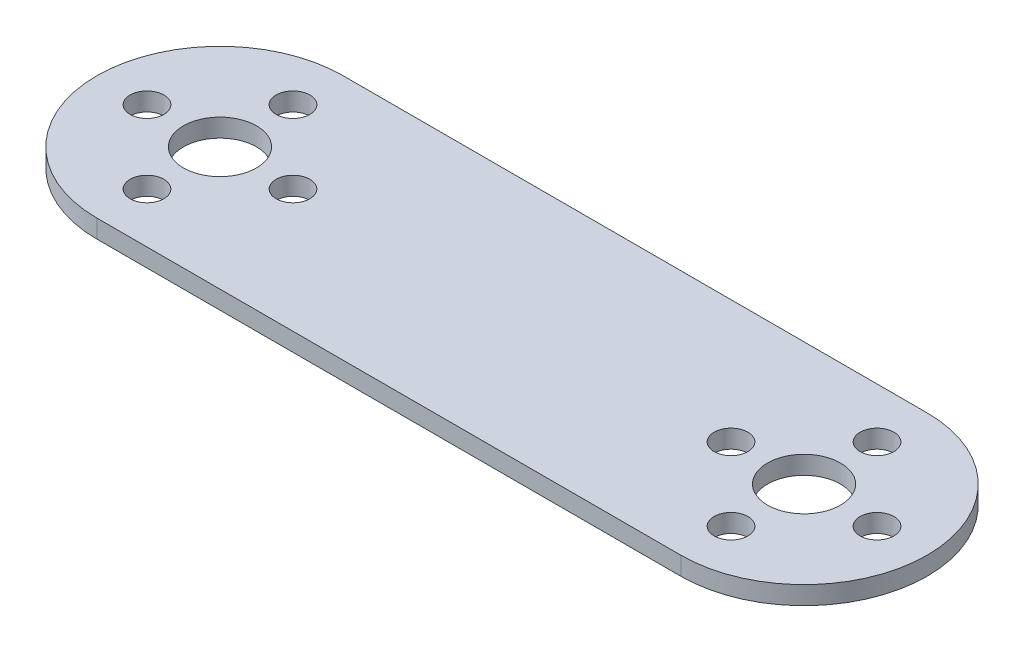
ISO-10303-21;
HEADER;
FILE_DESCRIPTION(('STEP AP214'),'2;1');
FILE_NAME('part.step','',(''),(''),'','','');
FILE_SCHEMA(('AUTOMOTIVE_DESIGN { 1 0 10303 214 1 1 1 1 }'));
ENDSEC;
DATA;
#1=APPLICATION_CONTEXT('core data for automotive mechanical design processes');
#2=APPLICATION_PROTOCOL_DEFINITION('international standard','automotive_design',2000,#1);
#3=PRODUCT_CONTEXT('',#1,'mechanical');
#4=PRODUCT('Part','Part','',(#3));
#5=PRODUCT_RELATED_PRODUCT_CATEGORY('part','',(#4));
#6=PRODUCT_DEFINITION_FORMATION('','',#4);
#7=PRODUCT_DEFINITION_CONTEXT('part definition',#1,'design');
#8=PRODUCT_DEFINITION('design','',#6,#7);
#9=PRODUCT_DEFINITION_SHAPE('','',#8);
#10=(LENGTH_UNIT() NAMED_UNIT(*) SI_UNIT(.MILLI.,.METRE.));
#11=(NAMED_UNIT(*) PLANE_ANGLE_UNIT() SI_UNIT($,.RADIAN.));
#12=(NAMED_UNIT(*) SI_UNIT($,.STERADIAN.) SOLID_ANGLE_UNIT());
#13=UNCERTAINTY_MEASURE_WITH_UNIT(LENGTH_MEASURE(1.E-05),#10,'distance_accuracy_value','');
#14=(GEOMETRIC_REPRESENTATION_CONTEXT(3) GLOBAL_UNCERTAINTY_ASSIGNED_CONTEXT((#13)) GLOBAL_UNIT_ASSIGNED_CONTEXT((#10,
#11,#12)) REPRESENTATION_CONTEXT('',''));
#15=CARTESIAN_POINT('',(0.,0.,0.));
#16=DIRECTION('',(0.,0.,1.));
#17=DIRECTION('',(1.,0.,0.));
#18=AXIS2_PLACEMENT_3D('',#15,#16,#17);
#19=CARTESIAN_POINT('',(32.,-1.,0.));
#20=DIRECTION('',(0.,1.,0.));
#21=DIRECTION('',(0.,0.,1.));
#22=AXIS2_PLACEMENT_3D('',#19,#20,#21);
#23=CYLINDRICAL_SURFACE('',#22,4.00000000000001);
#24=CARTESIAN_POINT('',(32.,-1.,0.));
#25=DIRECTION('',(0.,-1.,0.));
#26=DIRECTION('',(0.,0.,1.));
#27=AXIS2_PLACEMENT_3D('',#24,#25,#26);
#28=CIRCLE('',#27,4.00000000000001);
#29=CARTESIAN_POINT('',(32.,-1.,4.));
#30=VERTEX_POINT('',#29);
#31=EDGE_CURVE('E39',#30,#30,#28,.T.);
#32=ORIENTED_EDGE('',*,*,#31,.T.);
#33=EDGE_LOOP('',(#32));
#34=FACE_BOUND('',#33,.T.);
#35=CARTESIAN_POINT('',(32.,1.,0.));
#36=DIRECTION('',(0.,-1.,0.));
#37=DIRECTION('',(0.,0.,1.));
#38=AXIS2_PLACEMENT_3D('',#35,#36,#37);
#39=CIRCLE('',#38,4.00000000000001);
#40=CARTESIAN_POINT('',(32.,1.,4.));
#41=VERTEX_POINT('',#40);
#42=EDGE_CURVE('E11',#41,#41,#39,.T.);
#43=ORIENTED_EDGE('',*,*,#42,.F.);
#44=EDGE_LOOP('',(#43));
#45=FACE_BOUND('',#44,.T.);
#46=ADVANCED_FACE('F32',(#34,#45),#23,.F.);
#47=CARTESIAN_POINT('',(31.9999999999999,-1.,8.));
#48=DIRECTION('',(0.,1.,0.));
#49=DIRECTION('',(1.,0.,0.));
#50=AXIS2_PLACEMENT_3D('',#47,#48,#49);
#51=CYLINDRICAL_SURFACE('',#50,1.84999999999999);
#52=CARTESIAN_POINT('',(31.9999999999999,-1.,8.));
#53=DIRECTION('',(0.,-1.,0.));
#54=DIRECTION('',(1.,0.,0.));
#55=AXIS2_PLACEMENT_3D('',#52,#53,#54);
#56=CIRCLE('',#55,1.84999999999999);
#57=CARTESIAN_POINT('',(33.8499999999999,-1.,8.00000000000002));
#58=VERTEX_POINT('',#57);
#59=EDGE_CURVE('E149',#58,#58,#56,.T.);
#60=ORIENTED_EDGE('',*,*,#59,.T.);
#61=EDGE_LOOP('',(#60));
#62=FACE_BOUND('',#61,.T.);
#63=CARTESIAN_POINT('',(31.9999999999999,1.,8.));
#64=DIRECTION('',(0.,-1.,0.));
#65=DIRECTION('',(1.,0.,0.));
#66=AXIS2_PLACEMENT_3D('',#63,#64,#65);
#67=CIRCLE('',#66,1.84999999999999);
#68=CARTESIAN_POINT('',(33.8499999999999,1.,8.00000000000002));
#69=VERTEX_POINT('',#68);
#70=EDGE_CURVE('E152',#69,#69,#67,.T.);
#71=ORIENTED_EDGE('',*,*,#70,.F.);
#72=EDGE_LOOP('',(#71));
#73=FACE_BOUND('',#72,.T.);
#74=ADVANCED_FACE('F211',(#62,#73),#51,.F.);
#75=CARTESIAN_POINT('',(40.,-1.,0.));
#76=DIRECTION('',(0.,1.,0.));
#77=DIRECTION('',(0.,0.,-1.));
#78=AXIS2_PLACEMENT_3D('',#75,#76,#77);
#79=CYLINDRICAL_SURFACE('',#78,1.84999999999999);
#80=CARTESIAN_POINT('',(40.,-1.,0.));
#81=DIRECTION('',(0.,-1.,0.));
#82=DIRECTION('',(0.,0.,-1.));
#83=AXIS2_PLACEMENT_3D('',#80,#81,#82);
#84=CIRCLE('',#83,1.84999999999999);
#85=CARTESIAN_POINT('',(40.,-1.,-1.84999999999999));
#86=VERTEX_POINT('',#85);
#87=EDGE_CURVE('E143',#86,#86,#84,.T.);
#88=ORIENTED_EDGE('',*,*,#87,.T.);
#89=EDGE_LOOP('',(#88));
#90=FACE_BOUND('',#89,.T.);
#91=CARTESIAN_POINT('',(40.,1.,0.));
#92=DIRECTION('',(0.,-1.,0.));
#93=DIRECTION('',(0.,0.,-1.));
#94=AXIS2_PLACEMENT_3D('',#91,#92,#93);
#95=CIRCLE('',#94,1.84999999999999);
#96=CARTESIAN_POINT('',(40.,1.,-1.84999999999999));
#97=VERTEX_POINT('',#96);
#98=EDGE_CURVE('E146',#97,#97,#95,.T.);
#99=ORIENTED_EDGE('',*,*,#98,.F.);
#100=EDGE_LOOP('',(#99));
#101=FACE_BOUND('',#100,.T.);
#102=ADVANCED_FACE('F215',(#90,#101),#79,.F.);
#103=CARTESIAN_POINT('',(32.,-1.,-8.));
#104=DIRECTION('',(0.,1.,0.));
#105=DIRECTION('',(-1.,0.,0.));
#106=AXIS2_PLACEMENT_3D('',#103,#104,#105);
#107=CYLINDRICAL_SURFACE('',#106,1.84999999999999);
#108=CARTESIAN_POINT('',(32.,-1.,-8.));
#109=DIRECTION('',(0.,-1.,0.));
#110=DIRECTION('',(-1.,0.,0.));
#111=AXIS2_PLACEMENT_3D('',#108,#109,#110);
#112=CIRCLE('',#111,1.84999999999999);
#113=CARTESIAN_POINT('',(30.15,-1.,-8.00000000000001));
#114=VERTEX_POINT('',#113);
#115=EDGE_CURVE('E137',#114,#114,#112,.T.);
#116=ORIENTED_EDGE('',*,*,#115,.T.);
#117=EDGE_LOOP('',(#116));
#118=FACE_BOUND('',#117,.T.);
#119=CARTESIAN_POINT('',(32.,1.,-8.));
#120=DIRECTION('',(0.,-1.,0.));
#121=DIRECTION('',(-1.,0.,0.));
#122=AXIS2_PLACEMENT_3D('',#119,#120,#121);
#123=CIRCLE('',#122,1.84999999999999);
#124=CARTESIAN_POINT('',(30.15,1.,-8.00000000000001));
#125=VERTEX_POINT('',#124);
#126=EDGE_CURVE('E140',#125,#125,#123,.T.);
#127=ORIENTED_EDGE('',*,*,#126,.F.);
#128=EDGE_LOOP('',(#127));
#129=FACE_BOUND('',#128,.T.);
#130=ADVANCED_FACE('F220',(#118,#129),#107,.F.);
#131=CARTESIAN_POINT('',(24.,-1.,0.));
#132=DIRECTION('',(0.,1.,0.));
#133=DIRECTION('',(0.,0.,1.));
#134=AXIS2_PLACEMENT_3D('',#131,#132,#133);
#135=CYLINDRICAL_SURFACE('',#134,1.84999999999999);
#136=CARTESIAN_POINT('',(24.,-1.,0.));
#137=DIRECTION('',(0.,-1.,0.));
#138=DIRECTION('',(0.,0.,1.));
#139=AXIS2_PLACEMENT_3D('',#136,#137,#138);
#140=CIRCLE('',#139,1.84999999999999);
#141=CARTESIAN_POINT('',(24.,-1.,1.84999999999999));
#142=VERTEX_POINT('',#141);
#143=EDGE_CURVE('E131',#142,#142,#140,.T.);
#144=ORIENTED_EDGE('',*,*,#143,.T.);
#145=EDGE_LOOP('',(#144));
#146=FACE_BOUND('',#145,.T.);
#147=CARTESIAN_POINT('',(24.,1.,0.));
#148=DIRECTION('',(0.,-1.,0.));
#149=DIRECTION('',(0.,0.,1.));
#150=AXIS2_PLACEMENT_3D('',#147,#148,#149);
#151=CIRCLE('',#150,1.84999999999999);
#152=CARTESIAN_POINT('',(24.,1.,1.84999999999999));
#153=VERTEX_POINT('',#152);
#154=EDGE_CURVE('E134',#153,#153,#151,.T.);
#155=ORIENTED_EDGE('',*,*,#154,.F.);
#156=EDGE_LOOP('',(#155));
#157=FACE_BOUND('',#156,.T.);
#158=ADVANCED_FACE('F227',(#146,#157),#135,.F.);
#159=CARTESIAN_POINT('',(-31.9999999999999,-1.,8.));
#160=DIRECTION('',(0.,1.,0.));
#161=DIRECTION('',(-1.,0.,0.));
#162=AXIS2_PLACEMENT_3D('',#159,#160,#161);
#163=CYLINDRICAL_SURFACE('',#162,1.84999999999999);
#164=CARTESIAN_POINT('',(-31.9999999999999,-1.,8.));
#165=DIRECTION('',(0.,1.,0.));
#166=DIRECTION('',(-1.,0.,0.));
#167=AXIS2_PLACEMENT_3D('',#164,#165,#166);
#168=CIRCLE('',#167,1.84999999999999);
#169=CARTESIAN_POINT('',(-33.8499999999999,-1.,8.00000000000002));
#170=VERTEX_POINT('',#169);
#171=EDGE_CURVE('E125',#170,#170,#168,.T.);
#172=ORIENTED_EDGE('',*,*,#171,.F.);
#173=EDGE_LOOP('',(#172));
#174=FACE_BOUND('',#173,.T.);
#175=CARTESIAN_POINT('',(-31.9999999999999,1.,8.));
#176=DIRECTION('',(0.,1.,0.));
#177=DIRECTION('',(-1.,0.,0.));
#178=AXIS2_PLACEMENT_3D('',#175,#176,#177);
#179=CIRCLE('',#178,1.84999999999999);
#180=CARTESIAN_POINT('',(-33.8499999999999,1.,8.00000000000002));
#181=VERTEX_POINT('',#180);
#182=EDGE_CURVE('E128',#181,#181,#179,.T.);
#183=ORIENTED_EDGE('',*,*,#182,.T.);
#184=EDGE_LOOP('',(#183));
#185=FACE_BOUND('',#184,.T.);
#186=ADVANCED_FACE('F231',(#174,#185),#163,.F.);
#187=CARTESIAN_POINT('',(-40.,-1.,0.));
#188=DIRECTION('',(0.,1.,0.));
#189=DIRECTION('',(0.,0.,-1.));
#190=AXIS2_PLACEMENT_3D('',#187,#188,#189);
#191=CYLINDRICAL_SURFACE('',#190,1.84999999999999);
#192=CARTESIAN_POINT('',(-40.,-1.,0.));
#193=DIRECTION('',(0.,1.,0.));
#194=DIRECTION('',(0.,0.,-1.));
#195=AXIS2_PLACEMENT_3D('',#192,#193,#194);
#196=CIRCLE('',#195,1.84999999999999);
#197=CARTESIAN_POINT('',(-40.,-1.,-1.84999999999999));
#198=VERTEX_POINT('',#197);
#199=EDGE_CURVE('E119',#198,#198,#196,.T.);
#200=ORIENTED_EDGE('',*,*,#199,.F.);
#201=EDGE_LOOP('',(#200));
#202=FACE_BOUND('',#201,.T.);
#203=CARTESIAN_POINT('',(-40.,1.,0.));
#204=DIRECTION('',(0.,1.,0.));
#205=DIRECTION('',(0.,0.,-1.));
#206=AXIS2_PLACEMENT_3D('',#203,#204,#205);
#207=CIRCLE('',#206,1.84999999999999);
#208=CARTESIAN_POINT('',(-40.,1.,-1.84999999999999));
#209=VERTEX_POINT('',#208);
#210=EDGE_CURVE('E122',#209,#209,#207,.T.);
#211=ORIENTED_EDGE('',*,*,#210,.T.);
#212=EDGE_LOOP('',(#211));
#213=FACE_BOUND('',#212,.T.);
#214=ADVANCED_FACE('F207',(#202,#213),#191,.F.);
#215=CARTESIAN_POINT('',(-32.,-1.,-8.));
#216=DIRECTION('',(0.,1.,0.));
#217=DIRECTION('',(1.,0.,0.));
#218=AXIS2_PLACEMENT_3D('',#215,#216,#217);
#219=CYLINDRICAL_SURFACE('',#218,1.84999999999999);
#220=CARTESIAN_POINT('',(-32.,-1.,-8.));
#221=DIRECTION('',(0.,1.,0.));
#222=DIRECTION('',(1.,0.,0.));
#223=AXIS2_PLACEMENT_3D('',#220,#221,#222);
#224=CIRCLE('',#223,1.84999999999999);
#225=CARTESIAN_POINT('',(-30.15,-1.,-8.00000000000001));
#226=VERTEX_POINT('',#225);
#227=EDGE_CURVE('E113',#226,#226,#224,.T.);
#228=ORIENTED_EDGE('',*,*,#227,.F.);
#229=EDGE_LOOP('',(#228));
#230=FACE_BOUND('',#229,.T.);
#231=CARTESIAN_POINT('',(-32.,1.,-8.));
#232=DIRECTION('',(0.,1.,0.));
#233=DIRECTION('',(1.,0.,0.));
#234=AXIS2_PLACEMENT_3D('',#231,#232,#233);
#235=CIRCLE('',#234,1.84999999999999);
#236=CARTESIAN_POINT('',(-30.15,1.,-8.00000000000001));
#237=VERTEX_POINT('',#236);
#238=EDGE_CURVE('E116',#237,#237,#235,.T.);
#239=ORIENTED_EDGE('',*,*,#238,.T.);
#240=EDGE_LOOP('',(#239));
#241=FACE_BOUND('',#240,.T.);
#242=ADVANCED_FACE('F200',(#230,#241),#219,.F.);
#243=CARTESIAN_POINT('',(32.,-1.,0.));
#244=DIRECTION('',(0.,-1.,0.));
#245=DIRECTION('',(0.,0.,-1.));
#246=AXIS2_PLACEMENT_3D('',#243,#244,#245);
#247=CYLINDRICAL_SURFACE('',#246,13.5);
#248=DIRECTION('',(0.,-1.,0.));
#249=VECTOR('',#248,1.);
#250=CARTESIAN_POINT('',(32.,1.,13.5));
#251=LINE('',#250,#249);
#252=CARTESIAN_POINT('',(32.,-1.,13.5));
#253=VERTEX_POINT('',#252);
#254=CARTESIAN_POINT('',(32.,1.,13.5));
#255=VERTEX_POINT('',#254);
#256=EDGE_CURVE('E84',#253,#255,#251,.F.);
#257=ORIENTED_EDGE('',*,*,#256,.F.);
#258=CARTESIAN_POINT('',(32.,-1.,0.));
#259=DIRECTION('',(0.,-1.,0.));
#260=DIRECTION('',(0.,0.,-1.));
#261=AXIS2_PLACEMENT_3D('',#258,#259,#260);
#262=CIRCLE('',#261,13.5);
#263=CARTESIAN_POINT('',(32.,-1.,-13.5));
#264=VERTEX_POINT('',#263);
#265=EDGE_CURVE('E53',#264,#253,#262,.T.);
#266=ORIENTED_EDGE('',*,*,#265,.F.);
#267=DIRECTION('',(0.,-1.,0.));
#268=VECTOR('',#267,1.);
#269=CARTESIAN_POINT('',(32.,1.,-13.5));
#270=LINE('',#269,#268);
#271=CARTESIAN_POINT('',(32.,1.,-13.5));
#272=VERTEX_POINT('',#271);
#273=EDGE_CURVE('E109',#272,#264,#270,.T.);
#274=ORIENTED_EDGE('',*,*,#273,.F.);
#275=CARTESIAN_POINT('',(32.,1.,0.));
#276=DIRECTION('',(0.,-1.,0.));
#277=DIRECTION('',(0.,0.,-1.));
#278=AXIS2_PLACEMENT_3D('',#275,#276,#277);
#279=CIRCLE('',#278,13.5);
#280=EDGE_CURVE('E46',#255,#272,#279,.F.);
#281=ORIENTED_EDGE('',*,*,#280,.F.);
#282=EDGE_LOOP('',(#257,#266,#274,#281));
#283=FACE_BOUND('',#282,.T.);
#284=ADVANCED_FACE('F198',(#283),#247,.T.);
#285=CARTESIAN_POINT('',(-32.,1.,0.));
#286=DIRECTION('',(0.,-1.,0.));
#287=DIRECTION('',(0.,0.,-1.));
#288=AXIS2_PLACEMENT_3D('',#285,#286,#287);
#289=CYLINDRICAL_SURFACE('',#288,13.5);
#290=DIRECTION('',(0.,-1.,0.));
#291=VECTOR('',#290,1.);
#292=CARTESIAN_POINT('',(-32.,1.,13.5));
#293=LINE('',#292,#291);
#294=CARTESIAN_POINT('',(-32.,1.,13.5));
#295=VERTEX_POINT('',#294);
#296=CARTESIAN_POINT('',(-32.,-1.,13.5));
#297=VERTEX_POINT('',#296);
#298=EDGE_CURVE('E77',#295,#297,#293,.T.);
#299=ORIENTED_EDGE('',*,*,#298,.F.);
#300=CARTESIAN_POINT('',(-32.,1.,0.));
#301=DIRECTION('',(0.,-1.,0.));
#302=DIRECTION('',(0.,0.,-1.));
#303=AXIS2_PLACEMENT_3D('',#300,#301,#302);
#304=CIRCLE('',#303,13.5);
#305=CARTESIAN_POINT('',(-32.,1.,-13.5));
#306=VERTEX_POINT('',#305);
#307=EDGE_CURVE('E85',#306,#295,#304,.F.);
#308=ORIENTED_EDGE('',*,*,#307,.F.);
#309=DIRECTION('',(0.,-1.,0.));
#310=VECTOR('',#309,1.);
#311=CARTESIAN_POINT('',(-32.,1.,-13.5));
#312=LINE('',#311,#310);
#313=CARTESIAN_POINT('',(-32.,-1.,-13.5));
#314=VERTEX_POINT('',#313);
#315=EDGE_CURVE('E80',#314,#306,#312,.F.);
#316=ORIENTED_EDGE('',*,*,#315,.F.);
#317=CARTESIAN_POINT('',(-32.,-1.,0.));
#318=DIRECTION('',(0.,-1.,0.));
#319=DIRECTION('',(0.,0.,-1.));
#320=AXIS2_PLACEMENT_3D('',#317,#318,#319);
#321=CIRCLE('',#320,13.5);
#322=EDGE_CURVE('E73',#297,#314,#321,.T.);
#323=ORIENTED_EDGE('',*,*,#322,.F.);
#324=EDGE_LOOP('',(#299,#308,#316,#323));
#325=FACE_BOUND('',#324,.T.);
#326=ADVANCED_FACE('F75',(#325),#289,.T.);
#327=CARTESIAN_POINT('',(-45.5,1.,13.5));
#328=DIRECTION('',(0.,0.,-1.));
#329=DIRECTION('',(-1.,0.,0.));
#330=AXIS2_PLACEMENT_3D('',#327,#328,#329);
#331=PLANE('',#330);
#332=DIRECTION('',(1.,0.,0.));
#333=VECTOR('',#332,1.);
#334=CARTESIAN_POINT('',(-45.5,-1.,13.5));
#335=LINE('',#334,#333);
#336=EDGE_CURVE('E91',#297,#253,#335,.T.);
#337=ORIENTED_EDGE('',*,*,#336,.T.);
#338=ORIENTED_EDGE('',*,*,#256,.T.);
#339=DIRECTION('',(1.,0.,0.));
#340=VECTOR('',#339,1.);
#341=CARTESIAN_POINT('',(-45.5,1.,13.5));
#342=LINE('',#341,#340);
#343=EDGE_CURVE('E92',#295,#255,#342,.T.);
#344=ORIENTED_EDGE('',*,*,#343,.F.);
#345=ORIENTED_EDGE('',*,*,#298,.T.);
#346=EDGE_LOOP('',(#337,#338,#344,#345));
#347=FACE_BOUND('',#346,.T.);
#348=ADVANCED_FACE('F89',(#347),#331,.F.);
#349=CARTESIAN_POINT('',(-45.5,1.,-13.5));
#350=DIRECTION('',(0.,0.,1.));
#351=DIRECTION('',(1.,0.,0.));
#352=AXIS2_PLACEMENT_3D('',#349,#350,#351);
#353=PLANE('',#352);
#354=DIRECTION('',(-1.,0.,0.));
#355=VECTOR('',#354,1.);
#356=CARTESIAN_POINT('',(-45.5,1.,-13.5));
#357=LINE('',#356,#355);
#358=EDGE_CURVE('E93',#272,#306,#357,.T.);
#359=ORIENTED_EDGE('',*,*,#358,.F.);
#360=ORIENTED_EDGE('',*,*,#273,.T.);
#361=DIRECTION('',(-1.,0.,0.));
#362=VECTOR('',#361,1.);
#363=CARTESIAN_POINT('',(-45.5,-1.,-13.5));
#364=LINE('',#363,#362);
#365=EDGE_CURVE('E96',#264,#314,#364,.T.);
#366=ORIENTED_EDGE('',*,*,#365,.T.);
#367=ORIENTED_EDGE('',*,*,#315,.T.);
#368=EDGE_LOOP('',(#359,#360,#366,#367));
#369=FACE_BOUND('',#368,.T.);
#370=ADVANCED_FACE('F197',(#369),#353,.F.);
#371=CARTESIAN_POINT('',(-45.5,1.,-13.5));
#372=DIRECTION('',(0.,-1.,0.));
#373=DIRECTION('',(0.,0.,-1.));
#374=AXIS2_PLACEMENT_3D('',#371,#372,#373);
#375=PLANE('',#374);
#376=ORIENTED_EDGE('',*,*,#42,.T.);
#377=EDGE_LOOP('',(#376));
#378=FACE_BOUND('',#377,.T.);
#379=ORIENTED_EDGE('',*,*,#70,.T.);
#380=EDGE_LOOP('',(#379));
#381=FACE_BOUND('',#380,.T.);
#382=ORIENTED_EDGE('',*,*,#98,.T.);
#383=EDGE_LOOP('',(#382));
#384=FACE_BOUND('',#383,.T.);
#385=ORIENTED_EDGE('',*,*,#126,.T.);
#386=EDGE_LOOP('',(#385));
#387=FACE_BOUND('',#386,.T.);
#388=ORIENTED_EDGE('',*,*,#154,.T.);
#389=EDGE_LOOP('',(#388));
#390=FACE_BOUND('',#389,.T.);
#391=ORIENTED_EDGE('',*,*,#182,.F.);
#392=EDGE_LOOP('',(#391));
#393=FACE_BOUND('',#392,.T.);
#394=ORIENTED_EDGE('',*,*,#210,.F.);
#395=EDGE_LOOP('',(#394));
#396=FACE_BOUND('',#395,.T.);
#397=ORIENTED_EDGE('',*,*,#238,.F.);
#398=EDGE_LOOP('',(#397));
#399=FACE_BOUND('',#398,.T.);
#400=CARTESIAN_POINT('',(-24.,1.,0.));
#401=DIRECTION('',(0.,1.,0.));
#402=DIRECTION('',(0.,0.,1.));
#403=AXIS2_PLACEMENT_3D('',#400,#401,#402);
#404=CIRCLE('',#403,1.84999999999999);
#405=CARTESIAN_POINT('',(-24.,1.,1.84999999999999));
#406=VERTEX_POINT('',#405);
#407=EDGE_CURVE('E192',#406,#406,#404,.T.);
#408=ORIENTED_EDGE('',*,*,#407,.F.);
#409=EDGE_LOOP('',(#408));
#410=FACE_BOUND('',#409,.T.);
#411=CARTESIAN_POINT('',(-32.,1.,0.));
#412=DIRECTION('',(0.,1.,0.));
#413=DIRECTION('',(0.,0.,1.));
#414=AXIS2_PLACEMENT_3D('',#411,#412,#413);
#415=CIRCLE('',#414,4.00000000000001);
#416=CARTESIAN_POINT('',(-32.,1.,4.));
#417=VERTEX_POINT('',#416);
#418=EDGE_CURVE('E101',#417,#417,#415,.T.);
#419=ORIENTED_EDGE('',*,*,#418,.F.);
#420=EDGE_LOOP('',(#419));
#421=FACE_BOUND('',#420,.T.);
#422=ORIENTED_EDGE('',*,*,#343,.T.);
#423=ORIENTED_EDGE('',*,*,#280,.T.);
#424=ORIENTED_EDGE('',*,*,#358,.T.);
#425=ORIENTED_EDGE('',*,*,#307,.T.);
#426=EDGE_LOOP('',(#422,#423,#424,#425));
#427=FACE_BOUND('',#426,.T.);
#428=ADVANCED_FACE('F162',(#378,#381,#384,#387,#390,#393,#396,#399,#410,#421,#427),#375,.F.);
#429=CARTESIAN_POINT('',(-45.5,-1.,-13.5));
#430=DIRECTION('',(0.,-1.,0.));
#431=DIRECTION('',(0.,0.,-1.));
#432=AXIS2_PLACEMENT_3D('',#429,#430,#431);
#433=PLANE('',#432);
#434=ORIENTED_EDGE('',*,*,#31,.F.);
#435=EDGE_LOOP('',(#434));
#436=FACE_BOUND('',#435,.T.);
#437=ORIENTED_EDGE('',*,*,#59,.F.);
#438=EDGE_LOOP('',(#437));
#439=FACE_BOUND('',#438,.T.);
#440=ORIENTED_EDGE('',*,*,#87,.F.);
#441=EDGE_LOOP('',(#440));
#442=FACE_BOUND('',#441,.T.);
#443=ORIENTED_EDGE('',*,*,#115,.F.);
#444=EDGE_LOOP('',(#443));
#445=FACE_BOUND('',#444,.T.);
#446=ORIENTED_EDGE('',*,*,#143,.F.);
#447=EDGE_LOOP('',(#446));
#448=FACE_BOUND('',#447,.T.);
#449=ORIENTED_EDGE('',*,*,#171,.T.);
#450=EDGE_LOOP('',(#449));
#451=FACE_BOUND('',#450,.T.);
#452=ORIENTED_EDGE('',*,*,#199,.T.);
#453=EDGE_LOOP('',(#452));
#454=FACE_BOUND('',#453,.T.);
#455=ORIENTED_EDGE('',*,*,#227,.T.);
#456=EDGE_LOOP('',(#455));
#457=FACE_BOUND('',#456,.T.);
#458=CARTESIAN_POINT('',(-24.,-1.,0.));
#459=DIRECTION('',(0.,1.,0.));
#460=DIRECTION('',(0.,0.,1.));
#461=AXIS2_PLACEMENT_3D('',#458,#459,#460);
#462=CIRCLE('',#461,1.84999999999999);
#463=CARTESIAN_POINT('',(-24.,-1.,1.84999999999999));
#464=VERTEX_POINT('',#463);
#465=EDGE_CURVE('E181',#464,#464,#462,.T.);
#466=ORIENTED_EDGE('',*,*,#465,.T.);
#467=EDGE_LOOP('',(#466));
#468=FACE_BOUND('',#467,.T.);
#469=CARTESIAN_POINT('',(-32.,-1.,0.));
#470=DIRECTION('',(0.,1.,0.));
#471=DIRECTION('',(0.,0.,1.));
#472=AXIS2_PLACEMENT_3D('',#469,#470,#471);
#473=CIRCLE('',#472,4.00000000000001);
#474=CARTESIAN_POINT('',(-32.,-1.,4.));
#475=VERTEX_POINT('',#474);
#476=EDGE_CURVE('E97',#475,#475,#473,.T.);
#477=ORIENTED_EDGE('',*,*,#476,.T.);
#478=EDGE_LOOP('',(#477));
#479=FACE_BOUND('',#478,.T.);
#480=ORIENTED_EDGE('',*,*,#365,.F.);
#481=ORIENTED_EDGE('',*,*,#265,.T.);
#482=ORIENTED_EDGE('',*,*,#336,.F.);
#483=ORIENTED_EDGE('',*,*,#322,.T.);
#484=EDGE_LOOP('',(#480,#481,#482,#483));
#485=FACE_BOUND('',#484,.T.);
#486=ADVANCED_FACE('F95',(#436,#439,#442,#445,#448,#451,#454,#457,#468,#479,#485),#433,.T.);
#487=CARTESIAN_POINT('',(-32.,-1.,0.));
#488=DIRECTION('',(0.,1.,0.));
#489=DIRECTION('',(0.,0.,1.));
#490=AXIS2_PLACEMENT_3D('',#487,#488,#489);
#491=CYLINDRICAL_SURFACE('',#490,4.00000000000001);
#492=ORIENTED_EDGE('',*,*,#476,.F.);
#493=EDGE_LOOP('',(#492));
#494=FACE_BOUND('',#493,.T.);
#495=ORIENTED_EDGE('',*,*,#418,.T.);
#496=EDGE_LOOP('',(#495));
#497=FACE_BOUND('',#496,.T.);
#498=ADVANCED_FACE('F161',(#494,#497),#491,.F.);
#499=CARTESIAN_POINT('',(-24.,-1.,0.));
#500=DIRECTION('',(0.,1.,0.));
#501=DIRECTION('',(0.,0.,1.));
#502=AXIS2_PLACEMENT_3D('',#499,#500,#501);
#503=CYLINDRICAL_SURFACE('',#502,1.84999999999999);
#504=ORIENTED_EDGE('',*,*,#465,.F.);
#505=EDGE_LOOP('',(#504));
#506=FACE_BOUND('',#505,.T.);
#507=ORIENTED_EDGE('',*,*,#407,.T.);
#508=EDGE_LOOP('',(#507));
#509=FACE_BOUND('',#508,.T.);
#510=ADVANCED_FACE('F186',(#506,#509),#503,.F.);
#511=CLOSED_SHELL('',(#46,#74,#102,#130,#158,#186,#214,#242,#284,#326,#348,#370,#428,#486,#498,#510));
#512=MANIFOLD_SOLID_BREP('B2',#511);
#513=ADVANCED_BREP_SHAPE_REPRESENTATION('',(#18,#512),#14);
#514=SHAPE_DEFINITION_REPRESENTATION(#9,#513);
ENDSEC;
END-ISO-10303-21;
